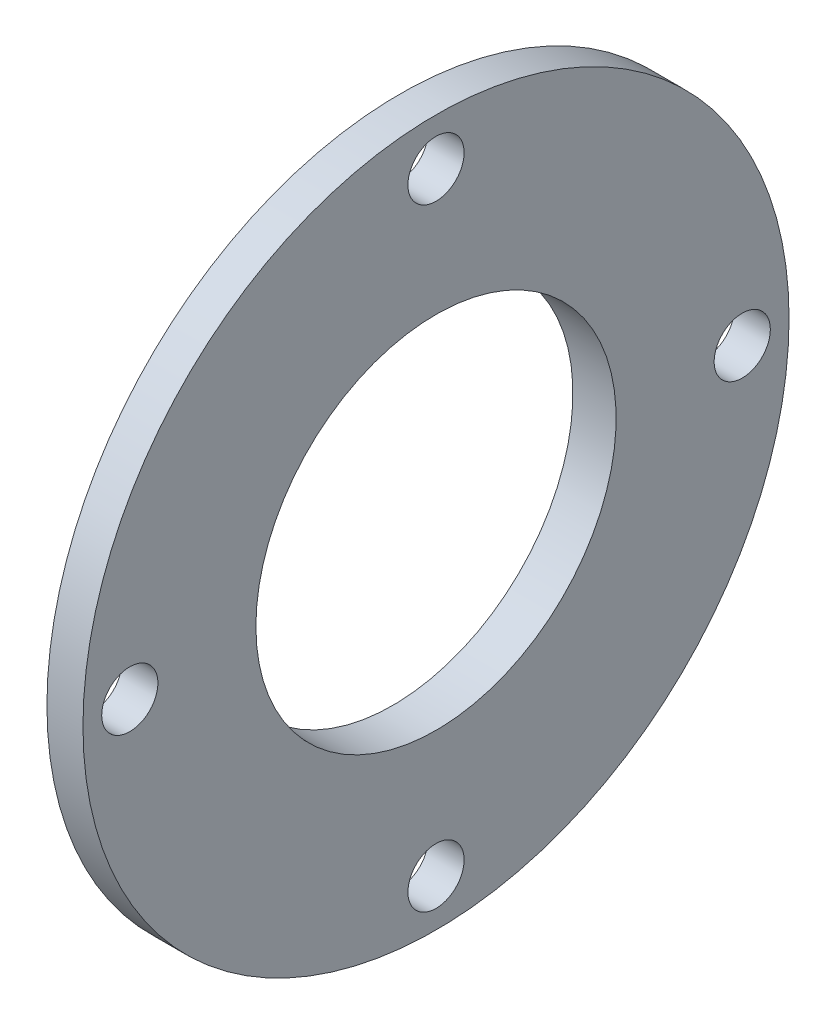
ISO-10303-21;
HEADER;
FILE_DESCRIPTION(('STEP AP214'),'2;1');
FILE_NAME('part.step','',(''),(''),'','','');
FILE_SCHEMA(('AUTOMOTIVE_DESIGN { 1 0 10303 214 1 1 1 1 }'));
ENDSEC;
DATA;
#1=APPLICATION_CONTEXT('core data for automotive mechanical design processes');
#2=APPLICATION_PROTOCOL_DEFINITION('international standard','automotive_design',2000,#1);
#3=PRODUCT_CONTEXT('',#1,'mechanical');
#4=PRODUCT('Part','Part','',(#3));
#5=PRODUCT_RELATED_PRODUCT_CATEGORY('part','',(#4));
#6=PRODUCT_DEFINITION_FORMATION('','',#4);
#7=PRODUCT_DEFINITION_CONTEXT('part definition',#1,'design');
#8=PRODUCT_DEFINITION('design','',#6,#7);
#9=PRODUCT_DEFINITION_SHAPE('','',#8);
#10=(LENGTH_UNIT() NAMED_UNIT(*) SI_UNIT(.MILLI.,.METRE.));
#11=(NAMED_UNIT(*) PLANE_ANGLE_UNIT() SI_UNIT($,.RADIAN.));
#12=(NAMED_UNIT(*) SI_UNIT($,.STERADIAN.) SOLID_ANGLE_UNIT());
#13=UNCERTAINTY_MEASURE_WITH_UNIT(LENGTH_MEASURE(1.E-05),#10,'distance_accuracy_value','');
#14=(GEOMETRIC_REPRESENTATION_CONTEXT(3) GLOBAL_UNCERTAINTY_ASSIGNED_CONTEXT((#13)) GLOBAL_UNIT_ASSIGNED_CONTEXT((#10,
#11,#12)) REPRESENTATION_CONTEXT('',''));
#15=CARTESIAN_POINT('',(0.,0.,0.));
#16=DIRECTION('',(0.,0.,1.));
#17=DIRECTION('',(1.,0.,0.));
#18=AXIS2_PLACEMENT_3D('',#15,#16,#17);
#19=CARTESIAN_POINT('',(0.,0.,0.));
#20=DIRECTION('',(-1.,0.,0.));
#21=DIRECTION('',(0.,0.,1.));
#22=AXIS2_PLACEMENT_3D('',#19,#20,#21);
#23=CYLINDRICAL_SURFACE('',#22,31.);
#24=CARTESIAN_POINT('',(0.,0.,0.));
#25=DIRECTION('',(-1.,0.,0.));
#26=DIRECTION('',(0.,0.,1.));
#27=AXIS2_PLACEMENT_3D('',#24,#25,#26);
#28=CIRCLE('',#27,31.);
#29=CARTESIAN_POINT('',(0.,0.,31.));
#30=VERTEX_POINT('',#29);
#31=EDGE_CURVE('E136',#30,#30,#28,.T.);
#32=ORIENTED_EDGE('',*,*,#31,.T.);
#33=EDGE_LOOP('',(#32));
#34=FACE_BOUND('',#33,.T.);
#35=CARTESIAN_POINT('',(2.,0.,0.));
#36=DIRECTION('',(-1.,0.,0.));
#37=DIRECTION('',(0.,0.,1.));
#38=AXIS2_PLACEMENT_3D('',#35,#36,#37);
#39=CIRCLE('',#38,31.);
#40=CARTESIAN_POINT('',(2.,0.,31.));
#41=VERTEX_POINT('',#40);
#42=EDGE_CURVE('E11',#41,#41,#39,.T.);
#43=ORIENTED_EDGE('',*,*,#42,.F.);
#44=EDGE_LOOP('',(#43));
#45=FACE_BOUND('',#44,.T.);
#46=ADVANCED_FACE('F114',(#34,#45),#23,.F.);
#47=CARTESIAN_POINT('',(2.,0.,0.));
#48=DIRECTION('',(-1.,0.,0.));
#49=DIRECTION('',(0.,0.,1.));
#50=AXIS2_PLACEMENT_3D('',#47,#48,#49);
#51=PLANE('',#50);
#52=ORIENTED_EDGE('',*,*,#42,.T.);
#53=EDGE_LOOP('',(#52));
#54=FACE_BOUND('',#53,.T.);
#55=CARTESIAN_POINT('',(2.,0.,0.));
#56=DIRECTION('',(-1.,0.,0.));
#57=DIRECTION('',(0.,0.,1.));
#58=AXIS2_PLACEMENT_3D('',#55,#56,#57);
#59=CIRCLE('',#58,25.);
#60=CARTESIAN_POINT('',(2.,0.,25.));
#61=VERTEX_POINT('',#60);
#62=EDGE_CURVE('E122',#61,#61,#59,.T.);
#63=ORIENTED_EDGE('',*,*,#62,.F.);
#64=EDGE_LOOP('',(#63));
#65=FACE_BOUND('',#64,.T.);
#66=ADVANCED_FACE('F186',(#54,#65),#51,.T.);
#67=CARTESIAN_POINT('',(0.,0.,0.));
#68=DIRECTION('',(-1.,0.,0.));
#69=DIRECTION('',(0.,0.,1.));
#70=AXIS2_PLACEMENT_3D('',#67,#68,#69);
#71=CYLINDRICAL_SURFACE('',#70,25.);
#72=ORIENTED_EDGE('',*,*,#62,.T.);
#73=EDGE_LOOP('',(#72));
#74=FACE_BOUND('',#73,.T.);
#75=CARTESIAN_POINT('',(8.,0.,0.));
#76=DIRECTION('',(-1.,0.,0.));
#77=DIRECTION('',(0.,0.,1.));
#78=AXIS2_PLACEMENT_3D('',#75,#76,#77);
#79=CIRCLE('',#78,25.);
#80=CARTESIAN_POINT('',(8.,0.,25.));
#81=VERTEX_POINT('',#80);
#82=EDGE_CURVE('E128',#81,#81,#79,.T.);
#83=ORIENTED_EDGE('',*,*,#82,.F.);
#84=EDGE_LOOP('',(#83));
#85=FACE_BOUND('',#84,.T.);
#86=ADVANCED_FACE('F184',(#74,#85),#71,.F.);
#87=CARTESIAN_POINT('',(8.,0.,0.));
#88=DIRECTION('',(1.,0.,0.));
#89=DIRECTION('',(0.,0.,-1.));
#90=AXIS2_PLACEMENT_3D('',#87,#88,#89);
#91=PLANE('',#90);
#92=CARTESIAN_POINT('',(8.,42.5,-4.451638707025E-13));
#93=DIRECTION('',(1.,0.,0.));
#94=DIRECTION('',(0.,1.,0.));
#95=AXIS2_PLACEMENT_3D('',#92,#93,#94);
#96=CIRCLE('',#95,3.9);
#97=CARTESIAN_POINT('',(8.,46.4,-4.86014202366964E-13));
#98=VERTEX_POINT('',#97);
#99=EDGE_CURVE('E333',#98,#98,#96,.T.);
#100=ORIENTED_EDGE('',*,*,#99,.F.);
#101=EDGE_LOOP('',(#100));
#102=FACE_BOUND('',#101,.T.);
#103=CARTESIAN_POINT('',(8.,0.,42.5));
#104=DIRECTION('',(1.,0.,0.));
#105=DIRECTION('',(0.,0.,1.));
#106=AXIS2_PLACEMENT_3D('',#103,#104,#105);
#107=CIRCLE('',#106,3.9);
#108=CARTESIAN_POINT('',(8.,0.,46.4));
#109=VERTEX_POINT('',#108);
#110=EDGE_CURVE('E335',#109,#109,#107,.T.);
#111=ORIENTED_EDGE('',*,*,#110,.F.);
#112=EDGE_LOOP('',(#111));
#113=FACE_BOUND('',#112,.T.);
#114=CARTESIAN_POINT('',(8.,-42.5,1.48387956900833E-13));
#115=DIRECTION('',(1.,0.,0.));
#116=DIRECTION('',(0.,-1.,0.));
#117=AXIS2_PLACEMENT_3D('',#114,#115,#116);
#118=CIRCLE('',#117,3.9);
#119=CARTESIAN_POINT('',(8.,-46.4,1.62004734122321E-13));
#120=VERTEX_POINT('',#119);
#121=EDGE_CURVE('E142',#120,#120,#118,.T.);
#122=ORIENTED_EDGE('',*,*,#121,.F.);
#123=EDGE_LOOP('',(#122));
#124=FACE_BOUND('',#123,.T.);
#125=CARTESIAN_POINT('',(8.,0.,-42.5));
#126=DIRECTION('',(1.,0.,0.));
#127=DIRECTION('',(0.,0.,-1.));
#128=AXIS2_PLACEMENT_3D('',#125,#126,#127);
#129=CIRCLE('',#128,3.9);
#130=CARTESIAN_POINT('',(8.,0.,-46.4));
#131=VERTEX_POINT('',#130);
#132=EDGE_CURVE('E137',#131,#131,#129,.T.);
#133=ORIENTED_EDGE('',*,*,#132,.F.);
#134=EDGE_LOOP('',(#133));
#135=FACE_BOUND('',#134,.T.);
#136=ORIENTED_EDGE('',*,*,#82,.T.);
#137=EDGE_LOOP('',(#136));
#138=FACE_BOUND('',#137,.T.);
#139=CARTESIAN_POINT('',(8.,0.,0.));
#140=DIRECTION('',(-1.,0.,0.));
#141=DIRECTION('',(0.,0.,1.));
#142=AXIS2_PLACEMENT_3D('',#139,#140,#141);
#143=CIRCLE('',#142,49.);
#144=CARTESIAN_POINT('',(8.,0.,49.));
#145=VERTEX_POINT('',#144);
#146=EDGE_CURVE('E174',#145,#145,#143,.T.);
#147=ORIENTED_EDGE('',*,*,#146,.F.);
#148=EDGE_LOOP('',(#147));
#149=FACE_BOUND('',#148,.T.);
#150=ADVANCED_FACE('F181',(#102,#113,#124,#135,#138,#149),#91,.T.);
#151=CARTESIAN_POINT('',(0.,0.,0.));
#152=DIRECTION('',(-1.,0.,0.));
#153=DIRECTION('',(0.,0.,1.));
#154=AXIS2_PLACEMENT_3D('',#151,#152,#153);
#155=CYLINDRICAL_SURFACE('',#154,49.);
#156=ORIENTED_EDGE('',*,*,#146,.T.);
#157=EDGE_LOOP('',(#156));
#158=FACE_BOUND('',#157,.T.);
#159=CARTESIAN_POINT('',(3.,0.,0.));
#160=DIRECTION('',(-1.,0.,0.));
#161=DIRECTION('',(0.,0.,1.));
#162=AXIS2_PLACEMENT_3D('',#159,#160,#161);
#163=CIRCLE('',#162,49.);
#164=CARTESIAN_POINT('',(3.,0.,49.));
#165=VERTEX_POINT('',#164);
#166=EDGE_CURVE('E170',#165,#165,#163,.T.);
#167=ORIENTED_EDGE('',*,*,#166,.F.);
#168=EDGE_LOOP('',(#167));
#169=FACE_BOUND('',#168,.T.);
#170=ADVANCED_FACE('F193',(#158,#169),#155,.T.);
#171=CARTESIAN_POINT('',(3.,0.,0.));
#172=DIRECTION('',(-1.,0.,0.));
#173=DIRECTION('',(0.,0.,1.));
#174=AXIS2_PLACEMENT_3D('',#171,#172,#173);
#175=PLANE('',#174);
#176=CARTESIAN_POINT('',(3.,42.5,-4.451638707025E-13));
#177=DIRECTION('',(-1.,0.,0.));
#178=DIRECTION('',(0.,0.,1.));
#179=AXIS2_PLACEMENT_3D('',#176,#177,#178);
#180=CIRCLE('',#179,3.9);
#181=CARTESIAN_POINT('',(3.,42.5,3.89999999999955));
#182=VERTEX_POINT('',#181);
#183=EDGE_CURVE('E117',#182,#182,#180,.F.);
#184=ORIENTED_EDGE('',*,*,#183,.T.);
#185=EDGE_LOOP('',(#184));
#186=FACE_BOUND('',#185,.T.);
#187=CARTESIAN_POINT('',(3.,0.,42.5));
#188=DIRECTION('',(-1.,0.,0.));
#189=DIRECTION('',(0.,0.,1.));
#190=AXIS2_PLACEMENT_3D('',#187,#188,#189);
#191=CIRCLE('',#190,3.9);
#192=CARTESIAN_POINT('',(3.,0.,46.4));
#193=VERTEX_POINT('',#192);
#194=EDGE_CURVE('E141',#193,#193,#191,.F.);
#195=ORIENTED_EDGE('',*,*,#194,.T.);
#196=EDGE_LOOP('',(#195));
#197=FACE_BOUND('',#196,.T.);
#198=CARTESIAN_POINT('',(3.,-42.5,1.48387956900833E-13));
#199=DIRECTION('',(-1.,0.,0.));
#200=DIRECTION('',(0.,0.,1.));
#201=AXIS2_PLACEMENT_3D('',#198,#199,#200);
#202=CIRCLE('',#201,3.9);
#203=CARTESIAN_POINT('',(3.,-42.5,3.90000000000015));
#204=VERTEX_POINT('',#203);
#205=EDGE_CURVE('E138',#204,#204,#202,.F.);
#206=ORIENTED_EDGE('',*,*,#205,.T.);
#207=EDGE_LOOP('',(#206));
#208=FACE_BOUND('',#207,.T.);
#209=CARTESIAN_POINT('',(3.,0.,-42.5));
#210=DIRECTION('',(-1.,0.,0.));
#211=DIRECTION('',(0.,0.,1.));
#212=AXIS2_PLACEMENT_3D('',#209,#210,#211);
#213=CIRCLE('',#212,3.9);
#214=CARTESIAN_POINT('',(3.,0.,-38.6));
#215=VERTEX_POINT('',#214);
#216=EDGE_CURVE('E132',#215,#215,#213,.F.);
#217=ORIENTED_EDGE('',*,*,#216,.T.);
#218=EDGE_LOOP('',(#217));
#219=FACE_BOUND('',#218,.T.);
#220=ORIENTED_EDGE('',*,*,#166,.T.);
#221=EDGE_LOOP('',(#220));
#222=FACE_BOUND('',#221,.T.);
#223=CARTESIAN_POINT('',(3.,0.,0.));
#224=DIRECTION('',(-1.,0.,0.));
#225=DIRECTION('',(0.,0.,1.));
#226=AXIS2_PLACEMENT_3D('',#223,#224,#225);
#227=CIRCLE('',#226,36.);
#228=CARTESIAN_POINT('',(3.,0.,36.));
#229=VERTEX_POINT('',#228);
#230=EDGE_CURVE('E166',#229,#229,#227,.T.);
#231=ORIENTED_EDGE('',*,*,#230,.F.);
#232=EDGE_LOOP('',(#231));
#233=FACE_BOUND('',#232,.T.);
#234=ADVANCED_FACE('F216',(#186,#197,#208,#219,#222,#233),#175,.T.);
#235=CARTESIAN_POINT('',(0.,0.,0.));
#236=DIRECTION('',(-1.,0.,0.));
#237=DIRECTION('',(0.,0.,1.));
#238=AXIS2_PLACEMENT_3D('',#235,#236,#237);
#239=CYLINDRICAL_SURFACE('',#238,36.);
#240=ORIENTED_EDGE('',*,*,#230,.T.);
#241=EDGE_LOOP('',(#240));
#242=FACE_BOUND('',#241,.T.);
#243=CARTESIAN_POINT('',(0.,0.,0.));
#244=DIRECTION('',(-1.,0.,0.));
#245=DIRECTION('',(0.,0.,1.));
#246=AXIS2_PLACEMENT_3D('',#243,#244,#245);
#247=CIRCLE('',#246,36.);
#248=CARTESIAN_POINT('',(0.,0.,36.));
#249=VERTEX_POINT('',#248);
#250=EDGE_CURVE('E162',#249,#249,#247,.T.);
#251=ORIENTED_EDGE('',*,*,#250,.F.);
#252=EDGE_LOOP('',(#251));
#253=FACE_BOUND('',#252,.T.);
#254=ADVANCED_FACE('F206',(#242,#253),#239,.T.);
#255=CARTESIAN_POINT('',(0.,0.,0.));
#256=DIRECTION('',(-1.,0.,0.));
#257=DIRECTION('',(0.,0.,1.));
#258=AXIS2_PLACEMENT_3D('',#255,#256,#257);
#259=PLANE('',#258);
#260=ORIENTED_EDGE('',*,*,#250,.T.);
#261=EDGE_LOOP('',(#260));
#262=FACE_BOUND('',#261,.T.);
#263=ORIENTED_EDGE('',*,*,#31,.F.);
#264=EDGE_LOOP('',(#263));
#265=FACE_BOUND('',#264,.T.);
#266=ADVANCED_FACE('F203',(#262,#265),#259,.T.);
#267=CARTESIAN_POINT('',(8.,0.,-42.5));
#268=DIRECTION('',(-1.,0.,0.));
#269=DIRECTION('',(0.,0.,1.));
#270=AXIS2_PLACEMENT_3D('',#267,#268,#269);
#271=CYLINDRICAL_SURFACE('',#270,3.9);
#272=ORIENTED_EDGE('',*,*,#216,.F.);
#273=EDGE_LOOP('',(#272));
#274=FACE_BOUND('',#273,.T.);
#275=ORIENTED_EDGE('',*,*,#132,.T.);
#276=EDGE_LOOP('',(#275));
#277=FACE_BOUND('',#276,.T.);
#278=ADVANCED_FACE('F205',(#274,#277),#271,.F.);
#279=CARTESIAN_POINT('',(8.,-42.5,1.48387956900833E-13));
#280=DIRECTION('',(-1.,0.,0.));
#281=DIRECTION('',(0.,0.,1.));
#282=AXIS2_PLACEMENT_3D('',#279,#280,#281);
#283=CYLINDRICAL_SURFACE('',#282,3.9);
#284=ORIENTED_EDGE('',*,*,#205,.F.);
#285=EDGE_LOOP('',(#284));
#286=FACE_BOUND('',#285,.T.);
#287=ORIENTED_EDGE('',*,*,#121,.T.);
#288=EDGE_LOOP('',(#287));
#289=FACE_BOUND('',#288,.T.);
#290=ADVANCED_FACE('F213',(#286,#289),#283,.F.);
#291=CARTESIAN_POINT('',(8.,0.,42.5));
#292=DIRECTION('',(-1.,0.,0.));
#293=DIRECTION('',(0.,0.,1.));
#294=AXIS2_PLACEMENT_3D('',#291,#292,#293);
#295=CYLINDRICAL_SURFACE('',#294,3.9);
#296=ORIENTED_EDGE('',*,*,#194,.F.);
#297=EDGE_LOOP('',(#296));
#298=FACE_BOUND('',#297,.T.);
#299=ORIENTED_EDGE('',*,*,#110,.T.);
#300=EDGE_LOOP('',(#299));
#301=FACE_BOUND('',#300,.T.);
#302=ADVANCED_FACE('F293',(#298,#301),#295,.F.);
#303=CARTESIAN_POINT('',(8.,42.5,-4.451638707025E-13));
#304=DIRECTION('',(-1.,0.,0.));
#305=DIRECTION('',(0.,0.,1.));
#306=AXIS2_PLACEMENT_3D('',#303,#304,#305);
#307=CYLINDRICAL_SURFACE('',#306,3.9);
#308=ORIENTED_EDGE('',*,*,#183,.F.);
#309=EDGE_LOOP('',(#308));
#310=FACE_BOUND('',#309,.T.);
#311=ORIENTED_EDGE('',*,*,#99,.T.);
#312=EDGE_LOOP('',(#311));
#313=FACE_BOUND('',#312,.T.);
#314=ADVANCED_FACE('F302',(#310,#313),#307,.F.);
#315=CLOSED_SHELL('',(#46,#66,#86,#150,#170,#234,#254,#266,#278,#290,#302,#314));
#316=MANIFOLD_SOLID_BREP('B2',#315);
#317=ADVANCED_BREP_SHAPE_REPRESENTATION('',(#18,#316),#14);
#318=SHAPE_DEFINITION_REPRESENTATION(#9,#317);
ENDSEC;
END-ISO-10303-21;
